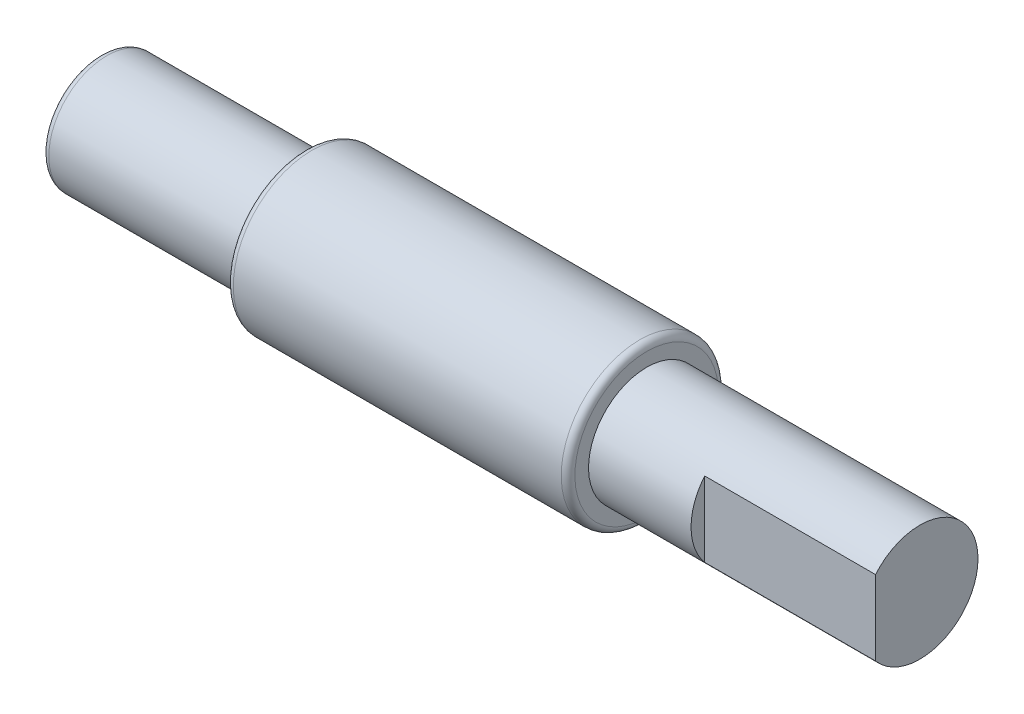
ISO-10303-21;
HEADER;
FILE_DESCRIPTION(('STEP AP214'),'2;1');
FILE_NAME('part.step','',(''),(''),'','','');
FILE_SCHEMA(('AUTOMOTIVE_DESIGN { 1 0 10303 214 1 1 1 1 }'));
ENDSEC;
DATA;
#1=APPLICATION_CONTEXT('core data for automotive mechanical design processes');
#2=APPLICATION_PROTOCOL_DEFINITION('international standard','automotive_design',2000,#1);
#3=PRODUCT_CONTEXT('',#1,'mechanical');
#4=PRODUCT('Part','Part','',(#3));
#5=PRODUCT_RELATED_PRODUCT_CATEGORY('part','',(#4));
#6=PRODUCT_DEFINITION_FORMATION('','',#4);
#7=PRODUCT_DEFINITION_CONTEXT('part definition',#1,'design');
#8=PRODUCT_DEFINITION('design','',#6,#7);
#9=PRODUCT_DEFINITION_SHAPE('','',#8);
#10=(LENGTH_UNIT() NAMED_UNIT(*) SI_UNIT(.MILLI.,.METRE.));
#11=(NAMED_UNIT(*) PLANE_ANGLE_UNIT() SI_UNIT($,.RADIAN.));
#12=(NAMED_UNIT(*) SI_UNIT($,.STERADIAN.) SOLID_ANGLE_UNIT());
#13=UNCERTAINTY_MEASURE_WITH_UNIT(LENGTH_MEASURE(1.E-05),#10,'distance_accuracy_value','');
#14=(GEOMETRIC_REPRESENTATION_CONTEXT(3) GLOBAL_UNCERTAINTY_ASSIGNED_CONTEXT((#13)) GLOBAL_UNIT_ASSIGNED_CONTEXT((#10,
#11,#12)) REPRESENTATION_CONTEXT('',''));
#15=CARTESIAN_POINT('',(0.,0.,0.));
#16=DIRECTION('',(0.,0.,1.));
#17=DIRECTION('',(1.,0.,0.));
#18=AXIS2_PLACEMENT_3D('',#15,#16,#17);
#19=CARTESIAN_POINT('',(0.,8.49999999999998,0.));
#20=DIRECTION('',(1.,0.,0.));
#21=DIRECTION('',(0.,1.,0.));
#22=AXIS2_PLACEMENT_3D('',#19,#20,#21);
#23=PLANE('',#22);
#24=DIRECTION('',(0.,1.,0.));
#25=VECTOR('',#24,1.);
#26=CARTESIAN_POINT('',(0.,9.40498784691044,6.5));
#27=LINE('',#26,#25);
#28=CARTESIAN_POINT('',(0.,-5.47722557505164,6.5));
#29=VERTEX_POINT('',#28);
#30=CARTESIAN_POINT('',(0.,5.47722557505164,6.5));
#31=VERTEX_POINT('',#30);
#32=EDGE_CURVE('E58',#29,#31,#27,.T.);
#33=ORIENTED_EDGE('',*,*,#32,.F.);
#34=CARTESIAN_POINT('',(0.,0.,0.));
#35=DIRECTION('',(1.,0.,0.));
#36=DIRECTION('',(0.,1.,0.));
#37=AXIS2_PLACEMENT_3D('',#34,#35,#36);
#38=CIRCLE('',#37,8.49999999999998);
#39=EDGE_CURVE('E64',#29,#31,#38,.T.);
#40=ORIENTED_EDGE('',*,*,#39,.T.);
#41=EDGE_LOOP('',(#33,#40));
#42=FACE_BOUND('',#41,.T.);
#43=ADVANCED_FACE('F32',(#42),#23,.T.);
#44=CARTESIAN_POINT('',(0.,0.,0.));
#45=DIRECTION('',(1.,0.,0.));
#46=DIRECTION('',(0.,1.,0.));
#47=AXIS2_PLACEMENT_3D('',#44,#45,#46);
#48=CYLINDRICAL_SURFACE('',#47,8.49999999999999);
#49=DIRECTION('',(1.,0.,0.));
#50=VECTOR('',#49,1.);
#51=CARTESIAN_POINT('',(0.,5.47722557505164,6.5));
#52=LINE('',#51,#50);
#53=CARTESIAN_POINT('',(-25.,5.47722557505164,6.5));
#54=VERTEX_POINT('',#53);
#55=EDGE_CURVE('E11',#31,#54,#52,.F.);
#56=ORIENTED_EDGE('',*,*,#55,.F.);
#57=ORIENTED_EDGE('',*,*,#39,.F.);
#58=DIRECTION('',(1.,0.,0.));
#59=VECTOR('',#58,1.);
#60=CARTESIAN_POINT('',(0.,-5.47722557505164,6.5));
#61=LINE('',#60,#59);
#62=CARTESIAN_POINT('',(-25.,-5.47722557505164,6.5));
#63=VERTEX_POINT('',#62);
#64=EDGE_CURVE('E39',#63,#29,#61,.T.);
#65=ORIENTED_EDGE('',*,*,#64,.F.);
#66=CARTESIAN_POINT('',(-25.,0.,0.));
#67=DIRECTION('',(-1.,0.,0.));
#68=DIRECTION('',(0.,-1.,0.));
#69=AXIS2_PLACEMENT_3D('',#66,#67,#68);
#70=CIRCLE('',#69,8.49999999999999);
#71=EDGE_CURVE('E48',#54,#63,#70,.F.);
#72=ORIENTED_EDGE('',*,*,#71,.F.);
#73=EDGE_LOOP('',(#56,#57,#65,#72));
#74=FACE_BOUND('',#73,.T.);
#75=CARTESIAN_POINT('',(-40.,0.,0.));
#76=DIRECTION('',(1.,0.,0.));
#77=DIRECTION('',(0.,1.,0.));
#78=AXIS2_PLACEMENT_3D('',#75,#76,#77);
#79=CIRCLE('',#78,8.49999999999999);
#80=CARTESIAN_POINT('',(-40.,8.49999999999998,0.));
#81=VERTEX_POINT('',#80);
#82=EDGE_CURVE('E68',#81,#81,#79,.T.);
#83=ORIENTED_EDGE('',*,*,#82,.T.);
#84=EDGE_LOOP('',(#83));
#85=FACE_BOUND('',#84,.T.);
#86=ADVANCED_FACE('F66',(#74,#85),#48,.T.);
#87=CARTESIAN_POINT('',(-40.,10.5,0.));
#88=DIRECTION('',(1.,0.,0.));
#89=DIRECTION('',(0.,1.,0.));
#90=AXIS2_PLACEMENT_3D('',#87,#88,#89);
#91=PLANE('',#90);
#92=CARTESIAN_POINT('',(-40.,0.,0.));
#93=DIRECTION('',(1.,0.,0.));
#94=DIRECTION('',(0.,1.,0.));
#95=AXIS2_PLACEMENT_3D('',#92,#93,#94);
#96=CIRCLE('',#95,10.5);
#97=CARTESIAN_POINT('',(-40.,10.5,0.));
#98=VERTEX_POINT('',#97);
#99=EDGE_CURVE('E72',#98,#98,#96,.T.);
#100=ORIENTED_EDGE('',*,*,#99,.T.);
#101=EDGE_LOOP('',(#100));
#102=FACE_BOUND('',#101,.T.);
#103=ORIENTED_EDGE('',*,*,#82,.F.);
#104=EDGE_LOOP('',(#103));
#105=FACE_BOUND('',#104,.T.);
#106=ADVANCED_FACE('F115',(#102,#105),#91,.T.);
#107=CARTESIAN_POINT('',(-41.,0.,0.));
#108=DIRECTION('',(1.,0.,0.));
#109=DIRECTION('',(0.,1.,0.));
#110=AXIS2_PLACEMENT_3D('',#107,#108,#109);
#111=TOROIDAL_SURFACE('',#110,10.5,1.);
#112=CARTESIAN_POINT('',(-41.,0.,0.));
#113=DIRECTION('',(1.,0.,0.));
#114=DIRECTION('',(0.,1.,0.));
#115=AXIS2_PLACEMENT_3D('',#112,#113,#114);
#116=CIRCLE('',#115,11.5);
#117=CARTESIAN_POINT('',(-41.,11.5,0.));
#118=VERTEX_POINT('',#117);
#119=EDGE_CURVE('E77',#118,#118,#116,.T.);
#120=ORIENTED_EDGE('',*,*,#119,.T.);
#121=EDGE_LOOP('',(#120));
#122=FACE_BOUND('',#121,.T.);
#123=ORIENTED_EDGE('',*,*,#99,.F.);
#124=EDGE_LOOP('',(#123));
#125=FACE_BOUND('',#124,.T.);
#126=ADVANCED_FACE('F119',(#122,#125),#111,.T.);
#127=CARTESIAN_POINT('',(0.,0.,0.));
#128=DIRECTION('',(1.,0.,0.));
#129=DIRECTION('',(0.,1.,0.));
#130=AXIS2_PLACEMENT_3D('',#127,#128,#129);
#131=CYLINDRICAL_SURFACE('',#130,11.5);
#132=CARTESIAN_POINT('',(-89.,0.,0.));
#133=DIRECTION('',(1.,0.,0.));
#134=DIRECTION('',(0.,1.,0.));
#135=AXIS2_PLACEMENT_3D('',#132,#133,#134);
#136=CIRCLE('',#135,11.5);
#137=CARTESIAN_POINT('',(-89.,11.5,0.));
#138=VERTEX_POINT('',#137);
#139=EDGE_CURVE('E80',#138,#138,#136,.T.);
#140=ORIENTED_EDGE('',*,*,#139,.T.);
#141=EDGE_LOOP('',(#140));
#142=FACE_BOUND('',#141,.T.);
#143=ORIENTED_EDGE('',*,*,#119,.F.);
#144=EDGE_LOOP('',(#143));
#145=FACE_BOUND('',#144,.T.);
#146=ADVANCED_FACE('F125',(#142,#145),#131,.T.);
#147=CARTESIAN_POINT('',(-89.,0.,0.));
#148=DIRECTION('',(1.,0.,0.));
#149=DIRECTION('',(0.,1.,0.));
#150=AXIS2_PLACEMENT_3D('',#147,#148,#149);
#151=TOROIDAL_SURFACE('',#150,10.5,1.);
#152=CARTESIAN_POINT('',(-90.,0.,0.));
#153=DIRECTION('',(1.,0.,0.));
#154=DIRECTION('',(0.,1.,0.));
#155=AXIS2_PLACEMENT_3D('',#152,#153,#154);
#156=CIRCLE('',#155,10.5);
#157=CARTESIAN_POINT('',(-90.,10.5,0.));
#158=VERTEX_POINT('',#157);
#159=EDGE_CURVE('E83',#158,#158,#156,.T.);
#160=ORIENTED_EDGE('',*,*,#159,.T.);
#161=EDGE_LOOP('',(#160));
#162=FACE_BOUND('',#161,.T.);
#163=ORIENTED_EDGE('',*,*,#139,.F.);
#164=EDGE_LOOP('',(#163));
#165=FACE_BOUND('',#164,.T.);
#166=ADVANCED_FACE('F129',(#162,#165),#151,.T.);
#167=CARTESIAN_POINT('',(-90.,8.49999999999999,0.));
#168=DIRECTION('',(-1.,0.,0.));
#169=DIRECTION('',(0.,-1.,0.));
#170=AXIS2_PLACEMENT_3D('',#167,#168,#169);
#171=PLANE('',#170);
#172=CARTESIAN_POINT('',(-90.,0.,0.));
#173=DIRECTION('',(1.,0.,0.));
#174=DIRECTION('',(0.,1.,0.));
#175=AXIS2_PLACEMENT_3D('',#172,#173,#174);
#176=CIRCLE('',#175,8.5);
#177=CARTESIAN_POINT('',(-90.,8.49999999999999,0.));
#178=VERTEX_POINT('',#177);
#179=EDGE_CURVE('E86',#178,#178,#176,.T.);
#180=ORIENTED_EDGE('',*,*,#179,.T.);
#181=EDGE_LOOP('',(#180));
#182=FACE_BOUND('',#181,.T.);
#183=ORIENTED_EDGE('',*,*,#159,.F.);
#184=EDGE_LOOP('',(#183));
#185=FACE_BOUND('',#184,.T.);
#186=ADVANCED_FACE('F133',(#182,#185),#171,.T.);
#187=CARTESIAN_POINT('',(0.,0.,0.));
#188=DIRECTION('',(1.,0.,0.));
#189=DIRECTION('',(0.,1.,0.));
#190=AXIS2_PLACEMENT_3D('',#187,#188,#189);
#191=CYLINDRICAL_SURFACE('',#190,8.5);
#192=CARTESIAN_POINT('',(-119.,0.,0.));
#193=DIRECTION('',(1.,0.,0.));
#194=DIRECTION('',(0.,1.,0.));
#195=AXIS2_PLACEMENT_3D('',#192,#193,#194);
#196=CIRCLE('',#195,8.5);
#197=CARTESIAN_POINT('',(-119.,8.49999999999999,0.));
#198=VERTEX_POINT('',#197);
#199=EDGE_CURVE('E89',#198,#198,#196,.T.);
#200=ORIENTED_EDGE('',*,*,#199,.T.);
#201=EDGE_LOOP('',(#200));
#202=FACE_BOUND('',#201,.T.);
#203=ORIENTED_EDGE('',*,*,#179,.F.);
#204=EDGE_LOOP('',(#203));
#205=FACE_BOUND('',#204,.T.);
#206=ADVANCED_FACE('F109',(#202,#205),#191,.T.);
#207=CARTESIAN_POINT('',(-119.,0.,0.));
#208=DIRECTION('',(1.,0.,0.));
#209=DIRECTION('',(0.,1.,0.));
#210=AXIS2_PLACEMENT_3D('',#207,#208,#209);
#211=TOROIDAL_SURFACE('',#210,7.5,1.);
#212=CARTESIAN_POINT('',(-120.,0.,0.));
#213=DIRECTION('',(1.,0.,0.));
#214=DIRECTION('',(0.,1.,0.));
#215=AXIS2_PLACEMENT_3D('',#212,#213,#214);
#216=CIRCLE('',#215,7.5);
#217=CARTESIAN_POINT('',(-120.,7.49999999999999,0.));
#218=VERTEX_POINT('',#217);
#219=EDGE_CURVE('E92',#218,#218,#216,.T.);
#220=ORIENTED_EDGE('',*,*,#219,.T.);
#221=EDGE_LOOP('',(#220));
#222=FACE_BOUND('',#221,.T.);
#223=ORIENTED_EDGE('',*,*,#199,.F.);
#224=EDGE_LOOP('',(#223));
#225=FACE_BOUND('',#224,.T.);
#226=ADVANCED_FACE('F97',(#222,#225),#211,.T.);
#227=CARTESIAN_POINT('',(-120.,0.,0.));
#228=DIRECTION('',(-1.,0.,0.));
#229=DIRECTION('',(0.,-1.,0.));
#230=AXIS2_PLACEMENT_3D('',#227,#228,#229);
#231=PLANE('',#230);
#232=ORIENTED_EDGE('',*,*,#219,.F.);
#233=EDGE_LOOP('',(#232));
#234=FACE_BOUND('',#233,.T.);
#235=ADVANCED_FACE('F100',(#234),#231,.T.);
#236=CARTESIAN_POINT('',(-25.,9.40498784691044,6.5));
#237=DIRECTION('',(0.,0.,-1.));
#238=DIRECTION('',(0.,1.,0.));
#239=AXIS2_PLACEMENT_3D('',#236,#237,#238);
#240=PLANE('',#239);
#241=ORIENTED_EDGE('',*,*,#55,.T.);
#242=DIRECTION('',(0.,1.,0.));
#243=VECTOR('',#242,1.);
#244=CARTESIAN_POINT('',(-25.,19.4049878469104,6.5));
#245=LINE('',#244,#243);
#246=EDGE_CURVE('E45',#63,#54,#245,.T.);
#247=ORIENTED_EDGE('',*,*,#246,.F.);
#248=ORIENTED_EDGE('',*,*,#64,.T.);
#249=ORIENTED_EDGE('',*,*,#32,.T.);
#250=EDGE_LOOP('',(#241,#247,#248,#249));
#251=FACE_BOUND('',#250,.T.);
#252=ADVANCED_FACE('F57',(#251),#240,.F.);
#253=CARTESIAN_POINT('',(-25.,0.,0.));
#254=DIRECTION('',(-1.,0.,0.));
#255=DIRECTION('',(0.,-1.,0.));
#256=AXIS2_PLACEMENT_3D('',#253,#254,#255);
#257=PLANE('',#256);
#258=ORIENTED_EDGE('',*,*,#71,.T.);
#259=ORIENTED_EDGE('',*,*,#246,.T.);
#260=EDGE_LOOP('',(#258,#259));
#261=FACE_BOUND('',#260,.T.);
#262=ADVANCED_FACE('F107',(#261),#257,.F.);
#263=CLOSED_SHELL('',(#43,#86,#106,#126,#146,#166,#186,#206,#226,#235,#252,#262));
#264=MANIFOLD_SOLID_BREP('B2',#263);
#265=ADVANCED_BREP_SHAPE_REPRESENTATION('',(#18,#264),#14);
#266=SHAPE_DEFINITION_REPRESENTATION(#9,#265);
ENDSEC;
END-ISO-10303-21;
